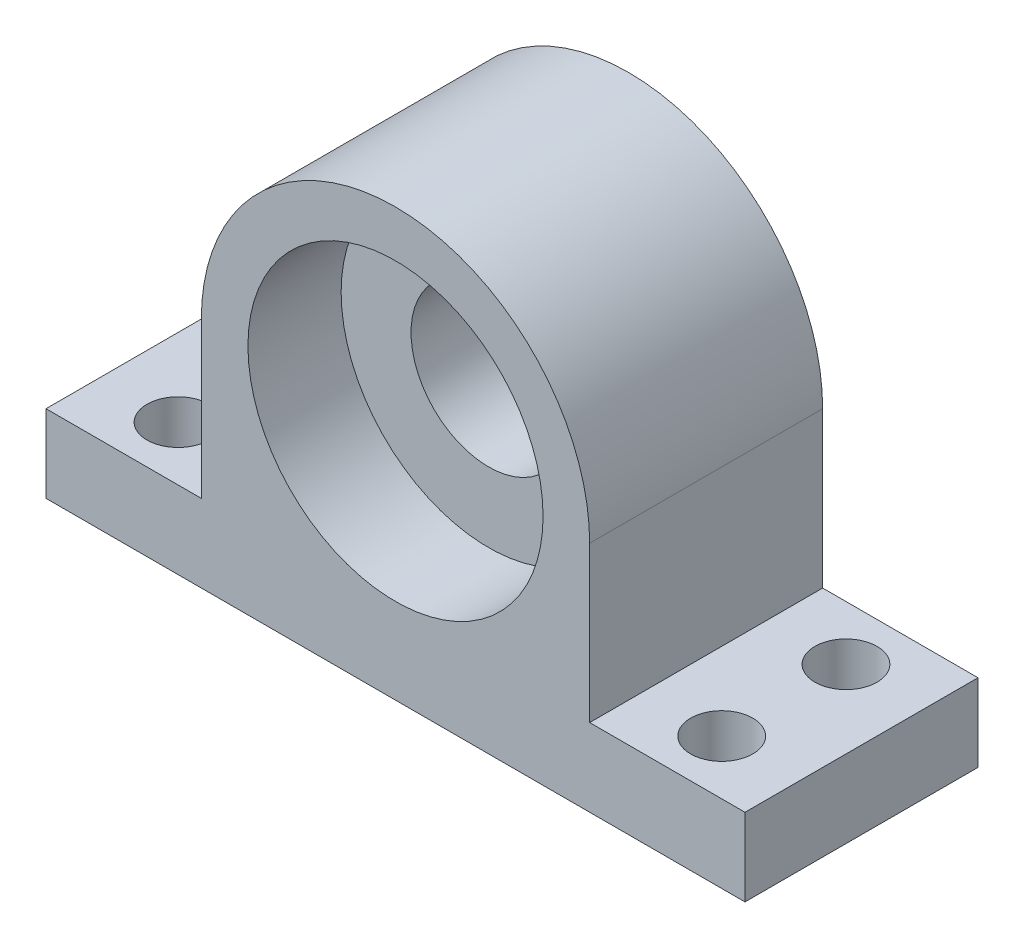
ISO-10303-21;
HEADER;
FILE_DESCRIPTION(('STEP AP214'),'2;1');
FILE_NAME('part.step','',(''),(''),'','','');
FILE_SCHEMA(('AUTOMOTIVE_DESIGN { 1 0 10303 214 1 1 1 1 }'));
ENDSEC;
DATA;
#1=APPLICATION_CONTEXT('core data for automotive mechanical design processes');
#2=APPLICATION_PROTOCOL_DEFINITION('international standard','automotive_design',2000,#1);
#3=PRODUCT_CONTEXT('',#1,'mechanical');
#4=PRODUCT('Part','Part','',(#3));
#5=PRODUCT_RELATED_PRODUCT_CATEGORY('part','',(#4));
#6=PRODUCT_DEFINITION_FORMATION('','',#4);
#7=PRODUCT_DEFINITION_CONTEXT('part definition',#1,'design');
#8=PRODUCT_DEFINITION('design','',#6,#7);
#9=PRODUCT_DEFINITION_SHAPE('','',#8);
#10=(LENGTH_UNIT() NAMED_UNIT(*) SI_UNIT(.MILLI.,.METRE.));
#11=(NAMED_UNIT(*) PLANE_ANGLE_UNIT() SI_UNIT($,.RADIAN.));
#12=(NAMED_UNIT(*) SI_UNIT($,.STERADIAN.) SOLID_ANGLE_UNIT());
#13=UNCERTAINTY_MEASURE_WITH_UNIT(LENGTH_MEASURE(1.E-05),#10,'distance_accuracy_value','');
#14=(GEOMETRIC_REPRESENTATION_CONTEXT(3) GLOBAL_UNCERTAINTY_ASSIGNED_CONTEXT((#13)) GLOBAL_UNIT_ASSIGNED_CONTEXT((#10,
#11,#12)) REPRESENTATION_CONTEXT('',''));
#15=CARTESIAN_POINT('',(0.,0.,0.));
#16=DIRECTION('',(0.,0.,1.));
#17=DIRECTION('',(1.,0.,0.));
#18=AXIS2_PLACEMENT_3D('',#15,#16,#17);
#19=CARTESIAN_POINT('',(0.,0.,15.));
#20=DIRECTION('',(0.,0.,-1.));
#21=DIRECTION('',(-1.,0.,0.));
#22=AXIS2_PLACEMENT_3D('',#19,#20,#21);
#23=CYLINDRICAL_SURFACE('',#22,5.);
#24=CARTESIAN_POINT('',(0.,0.,0.));
#25=DIRECTION('',(0.,0.,1.));
#26=DIRECTION('',(1.,0.,0.));
#27=AXIS2_PLACEMENT_3D('',#24,#25,#26);
#28=CIRCLE('',#27,5.);
#29=CARTESIAN_POINT('',(5.,0.,0.));
#30=VERTEX_POINT('',#29);
#31=EDGE_CURVE('E140',#30,#30,#28,.T.);
#32=ORIENTED_EDGE('',*,*,#31,.F.);
#33=EDGE_LOOP('',(#32));
#34=FACE_BOUND('',#33,.T.);
#35=CARTESIAN_POINT('',(0.,0.,9.));
#36=DIRECTION('',(0.,0.,1.));
#37=DIRECTION('',(1.,0.,0.));
#38=AXIS2_PLACEMENT_3D('',#35,#36,#37);
#39=CIRCLE('',#38,5.);
#40=CARTESIAN_POINT('',(5.,0.,9.));
#41=VERTEX_POINT('',#40);
#42=EDGE_CURVE('E42',#41,#41,#39,.T.);
#43=ORIENTED_EDGE('',*,*,#42,.T.);
#44=EDGE_LOOP('',(#43));
#45=FACE_BOUND('',#44,.T.);
#46=ADVANCED_FACE('F38',(#34,#45),#23,.F.);
#47=CARTESIAN_POINT('',(0.,0.,15.));
#48=DIRECTION('',(0.,0.,1.));
#49=DIRECTION('',(1.,0.,0.));
#50=AXIS2_PLACEMENT_3D('',#47,#48,#49);
#51=PLANE('',#50);
#52=CARTESIAN_POINT('',(0.,0.,15.));
#53=DIRECTION('',(0.,0.,1.));
#54=DIRECTION('',(1.,0.,0.));
#55=AXIS2_PLACEMENT_3D('',#52,#53,#54);
#56=CIRCLE('',#55,9.5);
#57=CARTESIAN_POINT('',(9.5,0.,15.));
#58=VERTEX_POINT('',#57);
#59=EDGE_CURVE('E188',#58,#58,#56,.T.);
#60=ORIENTED_EDGE('',*,*,#59,.F.);
#61=EDGE_LOOP('',(#60));
#62=FACE_BOUND('',#61,.T.);
#63=DIRECTION('',(0.,-1.,0.));
#64=VECTOR('',#63,1.);
#65=CARTESIAN_POINT('',(-22.5,-10.,15.));
#66=LINE('',#65,#64);
#67=CARTESIAN_POINT('',(-22.5,-10.,15.));
#68=VERTEX_POINT('',#67);
#69=CARTESIAN_POINT('',(-22.5,-15.,15.));
#70=VERTEX_POINT('',#69);
#71=EDGE_CURVE('E151',#68,#70,#66,.T.);
#72=ORIENTED_EDGE('',*,*,#71,.T.);
#73=DIRECTION('',(1.,0.,0.));
#74=VECTOR('',#73,1.);
#75=CARTESIAN_POINT('',(-22.5,-15.,15.));
#76=LINE('',#75,#74);
#77=CARTESIAN_POINT('',(22.5,-15.,15.));
#78=VERTEX_POINT('',#77);
#79=EDGE_CURVE('E99',#70,#78,#76,.T.);
#80=ORIENTED_EDGE('',*,*,#79,.T.);
#81=DIRECTION('',(0.,1.,0.));
#82=VECTOR('',#81,1.);
#83=CARTESIAN_POINT('',(22.5,-10.,15.));
#84=LINE('',#83,#82);
#85=CARTESIAN_POINT('',(22.5,-10.,15.));
#86=VERTEX_POINT('',#85);
#87=EDGE_CURVE('E167',#78,#86,#84,.T.);
#88=ORIENTED_EDGE('',*,*,#87,.T.);
#89=DIRECTION('',(-1.,0.,0.));
#90=VECTOR('',#89,1.);
#91=CARTESIAN_POINT('',(12.5,-10.,15.));
#92=LINE('',#91,#90);
#93=CARTESIAN_POINT('',(12.5,-10.,15.));
#94=VERTEX_POINT('',#93);
#95=EDGE_CURVE('E180',#86,#94,#92,.T.);
#96=ORIENTED_EDGE('',*,*,#95,.T.);
#97=DIRECTION('',(0.,1.,0.));
#98=VECTOR('',#97,1.);
#99=CARTESIAN_POINT('',(12.5,0.,15.));
#100=LINE('',#99,#98);
#101=CARTESIAN_POINT('',(12.5,0.,15.));
#102=VERTEX_POINT('',#101);
#103=EDGE_CURVE('E118',#94,#102,#100,.T.);
#104=ORIENTED_EDGE('',*,*,#103,.T.);
#105=CARTESIAN_POINT('',(0.,0.,15.));
#106=DIRECTION('',(0.,0.,1.));
#107=DIRECTION('',(1.,0.,0.));
#108=AXIS2_PLACEMENT_3D('',#105,#106,#107);
#109=CIRCLE('',#108,12.5);
#110=CARTESIAN_POINT('',(-12.5,0.,15.));
#111=VERTEX_POINT('',#110);
#112=EDGE_CURVE('E112',#102,#111,#109,.T.);
#113=ORIENTED_EDGE('',*,*,#112,.T.);
#114=DIRECTION('',(0.,-1.,0.));
#115=VECTOR('',#114,1.);
#116=CARTESIAN_POINT('',(-12.5,0.,15.));
#117=LINE('',#116,#115);
#118=CARTESIAN_POINT('',(-12.5,-10.,15.));
#119=VERTEX_POINT('',#118);
#120=EDGE_CURVE('E116',#111,#119,#117,.T.);
#121=ORIENTED_EDGE('',*,*,#120,.T.);
#122=DIRECTION('',(-1.,0.,0.));
#123=VECTOR('',#122,1.);
#124=CARTESIAN_POINT('',(-22.5,-10.,15.));
#125=LINE('',#124,#123);
#126=EDGE_CURVE('E56',#119,#68,#125,.T.);
#127=ORIENTED_EDGE('',*,*,#126,.T.);
#128=EDGE_LOOP('',(#72,#80,#88,#96,#104,#113,#121,#127));
#129=FACE_BOUND('',#128,.T.);
#130=ADVANCED_FACE('F114',(#62,#129),#51,.T.);
#131=CARTESIAN_POINT('',(0.,0.,0.));
#132=DIRECTION('',(0.,0.,1.));
#133=DIRECTION('',(1.,0.,0.));
#134=AXIS2_PLACEMENT_3D('',#131,#132,#133);
#135=PLANE('',#134);
#136=DIRECTION('',(0.,-1.,0.));
#137=VECTOR('',#136,1.);
#138=CARTESIAN_POINT('',(-22.5,-10.,0.));
#139=LINE('',#138,#137);
#140=CARTESIAN_POINT('',(-22.5,-10.,0.));
#141=VERTEX_POINT('',#140);
#142=CARTESIAN_POINT('',(-22.5,-15.,0.));
#143=VERTEX_POINT('',#142);
#144=EDGE_CURVE('E136',#141,#143,#139,.T.);
#145=ORIENTED_EDGE('',*,*,#144,.F.);
#146=DIRECTION('',(-1.,0.,0.));
#147=VECTOR('',#146,1.);
#148=CARTESIAN_POINT('',(-22.5,-10.,0.));
#149=LINE('',#148,#147);
#150=CARTESIAN_POINT('',(-12.5,-10.,0.));
#151=VERTEX_POINT('',#150);
#152=EDGE_CURVE('E91',#151,#141,#149,.T.);
#153=ORIENTED_EDGE('',*,*,#152,.F.);
#154=DIRECTION('',(0.,-1.,0.));
#155=VECTOR('',#154,1.);
#156=CARTESIAN_POINT('',(-12.5,0.,0.));
#157=LINE('',#156,#155);
#158=CARTESIAN_POINT('',(-12.5,0.,0.));
#159=VERTEX_POINT('',#158);
#160=EDGE_CURVE('E85',#159,#151,#157,.T.);
#161=ORIENTED_EDGE('',*,*,#160,.F.);
#162=CARTESIAN_POINT('',(0.,0.,0.));
#163=DIRECTION('',(0.,0.,1.));
#164=DIRECTION('',(1.,0.,0.));
#165=AXIS2_PLACEMENT_3D('',#162,#163,#164);
#166=CIRCLE('',#165,12.5);
#167=CARTESIAN_POINT('',(12.5,0.,0.));
#168=VERTEX_POINT('',#167);
#169=EDGE_CURVE('E126',#168,#159,#166,.T.);
#170=ORIENTED_EDGE('',*,*,#169,.F.);
#171=DIRECTION('',(0.,1.,0.));
#172=VECTOR('',#171,1.);
#173=CARTESIAN_POINT('',(12.5,0.,0.));
#174=LINE('',#173,#172);
#175=CARTESIAN_POINT('',(12.5,-10.,0.));
#176=VERTEX_POINT('',#175);
#177=EDGE_CURVE('E146',#176,#168,#174,.T.);
#178=ORIENTED_EDGE('',*,*,#177,.F.);
#179=DIRECTION('',(-1.,0.,0.));
#180=VECTOR('',#179,1.);
#181=CARTESIAN_POINT('',(12.5,-10.,0.));
#182=LINE('',#181,#180);
#183=CARTESIAN_POINT('',(22.5,-10.,0.));
#184=VERTEX_POINT('',#183);
#185=EDGE_CURVE('E144',#184,#176,#182,.T.);
#186=ORIENTED_EDGE('',*,*,#185,.F.);
#187=DIRECTION('',(0.,1.,0.));
#188=VECTOR('',#187,1.);
#189=CARTESIAN_POINT('',(22.5,-10.,0.));
#190=LINE('',#189,#188);
#191=CARTESIAN_POINT('',(22.5,-15.,0.));
#192=VERTEX_POINT('',#191);
#193=EDGE_CURVE('E142',#192,#184,#190,.T.);
#194=ORIENTED_EDGE('',*,*,#193,.F.);
#195=DIRECTION('',(1.,0.,0.));
#196=VECTOR('',#195,1.);
#197=CARTESIAN_POINT('',(-22.5,-15.,0.));
#198=LINE('',#197,#196);
#199=EDGE_CURVE('E139',#143,#192,#198,.T.);
#200=ORIENTED_EDGE('',*,*,#199,.F.);
#201=EDGE_LOOP('',(#145,#153,#161,#170,#178,#186,#194,#200));
#202=FACE_BOUND('',#201,.T.);
#203=ORIENTED_EDGE('',*,*,#31,.T.);
#204=EDGE_LOOP('',(#203));
#205=FACE_BOUND('',#204,.T.);
#206=ADVANCED_FACE('F171',(#202,#205),#135,.F.);
#207=CARTESIAN_POINT('',(-22.5,-10.,15.));
#208=DIRECTION('',(1.,0.,0.));
#209=DIRECTION('',(0.,0.,-1.));
#210=AXIS2_PLACEMENT_3D('',#207,#208,#209);
#211=PLANE('',#210);
#212=ORIENTED_EDGE('',*,*,#144,.T.);
#213=DIRECTION('',(0.,0.,-1.));
#214=VECTOR('',#213,1.);
#215=CARTESIAN_POINT('',(-22.5,-15.,15.));
#216=LINE('',#215,#214);
#217=EDGE_CURVE('E11',#70,#143,#216,.T.);
#218=ORIENTED_EDGE('',*,*,#217,.F.);
#219=ORIENTED_EDGE('',*,*,#71,.F.);
#220=DIRECTION('',(0.,0.,-1.));
#221=VECTOR('',#220,1.);
#222=CARTESIAN_POINT('',(-22.5,-10.,15.));
#223=LINE('',#222,#221);
#224=EDGE_CURVE('E132',#68,#141,#223,.T.);
#225=ORIENTED_EDGE('',*,*,#224,.T.);
#226=EDGE_LOOP('',(#212,#218,#219,#225));
#227=FACE_BOUND('',#226,.T.);
#228=ADVANCED_FACE('F40',(#227),#211,.F.);
#229=CARTESIAN_POINT('',(-22.5,-15.,15.));
#230=DIRECTION('',(0.,1.,0.));
#231=DIRECTION('',(0.,0.,1.));
#232=AXIS2_PLACEMENT_3D('',#229,#230,#231);
#233=PLANE('',#232);
#234=CARTESIAN_POINT('',(-17.5,-15.,3.5));
#235=DIRECTION('',(0.,1.,0.));
#236=DIRECTION('',(0.,0.,1.));
#237=AXIS2_PLACEMENT_3D('',#234,#235,#236);
#238=CIRCLE('',#237,2.);
#239=CARTESIAN_POINT('',(-17.5,-15.,5.5));
#240=VERTEX_POINT('',#239);
#241=EDGE_CURVE('E200',#240,#240,#238,.T.);
#242=ORIENTED_EDGE('',*,*,#241,.T.);
#243=EDGE_LOOP('',(#242));
#244=FACE_BOUND('',#243,.T.);
#245=CARTESIAN_POINT('',(-17.5,-15.,11.5));
#246=DIRECTION('',(0.,1.,0.));
#247=DIRECTION('',(0.,0.,1.));
#248=AXIS2_PLACEMENT_3D('',#245,#246,#247);
#249=CIRCLE('',#248,2.);
#250=CARTESIAN_POINT('',(-17.5,-15.,13.5));
#251=VERTEX_POINT('',#250);
#252=EDGE_CURVE('E203',#251,#251,#249,.T.);
#253=ORIENTED_EDGE('',*,*,#252,.T.);
#254=EDGE_LOOP('',(#253));
#255=FACE_BOUND('',#254,.T.);
#256=CARTESIAN_POINT('',(17.5,-15.,11.5));
#257=DIRECTION('',(0.,1.,0.));
#258=DIRECTION('',(0.,0.,1.));
#259=AXIS2_PLACEMENT_3D('',#256,#257,#258);
#260=CIRCLE('',#259,2.);
#261=CARTESIAN_POINT('',(17.5,-15.,13.5));
#262=VERTEX_POINT('',#261);
#263=EDGE_CURVE('E192',#262,#262,#260,.T.);
#264=ORIENTED_EDGE('',*,*,#263,.T.);
#265=EDGE_LOOP('',(#264));
#266=FACE_BOUND('',#265,.T.);
#267=CARTESIAN_POINT('',(17.5,-15.,3.5));
#268=DIRECTION('',(0.,1.,0.));
#269=DIRECTION('',(0.,0.,1.));
#270=AXIS2_PLACEMENT_3D('',#267,#268,#269);
#271=CIRCLE('',#270,2.);
#272=CARTESIAN_POINT('',(17.5,-15.,5.5));
#273=VERTEX_POINT('',#272);
#274=EDGE_CURVE('E197',#273,#273,#271,.T.);
#275=ORIENTED_EDGE('',*,*,#274,.T.);
#276=EDGE_LOOP('',(#275));
#277=FACE_BOUND('',#276,.T.);
#278=ORIENTED_EDGE('',*,*,#199,.T.);
#279=DIRECTION('',(0.,0.,-1.));
#280=VECTOR('',#279,1.);
#281=CARTESIAN_POINT('',(22.5,-15.,15.));
#282=LINE('',#281,#280);
#283=EDGE_CURVE('E48',#78,#192,#282,.T.);
#284=ORIENTED_EDGE('',*,*,#283,.F.);
#285=ORIENTED_EDGE('',*,*,#79,.F.);
#286=ORIENTED_EDGE('',*,*,#217,.T.);
#287=EDGE_LOOP('',(#278,#284,#285,#286));
#288=FACE_BOUND('',#287,.T.);
#289=ADVANCED_FACE('F234',(#244,#255,#266,#277,#288),#233,.F.);
#290=CARTESIAN_POINT('',(22.5,-10.,15.));
#291=DIRECTION('',(-1.,0.,0.));
#292=DIRECTION('',(0.,0.,1.));
#293=AXIS2_PLACEMENT_3D('',#290,#291,#292);
#294=PLANE('',#293);
#295=ORIENTED_EDGE('',*,*,#193,.T.);
#296=DIRECTION('',(0.,0.,-1.));
#297=VECTOR('',#296,1.);
#298=CARTESIAN_POINT('',(22.5,-10.,15.));
#299=LINE('',#298,#297);
#300=EDGE_CURVE('E158',#86,#184,#299,.T.);
#301=ORIENTED_EDGE('',*,*,#300,.F.);
#302=ORIENTED_EDGE('',*,*,#87,.F.);
#303=ORIENTED_EDGE('',*,*,#283,.T.);
#304=EDGE_LOOP('',(#295,#301,#302,#303));
#305=FACE_BOUND('',#304,.T.);
#306=ADVANCED_FACE('F165',(#305),#294,.F.);
#307=CARTESIAN_POINT('',(12.5,-10.,15.));
#308=DIRECTION('',(0.,-1.,0.));
#309=DIRECTION('',(0.,0.,-1.));
#310=AXIS2_PLACEMENT_3D('',#307,#308,#309);
#311=PLANE('',#310);
#312=CARTESIAN_POINT('',(17.5,-10.,11.5));
#313=DIRECTION('',(0.,1.,0.));
#314=DIRECTION('',(0.,0.,1.));
#315=AXIS2_PLACEMENT_3D('',#312,#313,#314);
#316=CIRCLE('',#315,2.);
#317=CARTESIAN_POINT('',(17.5,-10.,13.5));
#318=VERTEX_POINT('',#317);
#319=EDGE_CURVE('E209',#318,#318,#316,.T.);
#320=ORIENTED_EDGE('',*,*,#319,.F.);
#321=EDGE_LOOP('',(#320));
#322=FACE_BOUND('',#321,.T.);
#323=CARTESIAN_POINT('',(17.5,-10.,3.5));
#324=DIRECTION('',(0.,1.,0.));
#325=DIRECTION('',(0.,0.,1.));
#326=AXIS2_PLACEMENT_3D('',#323,#324,#325);
#327=CIRCLE('',#326,2.);
#328=CARTESIAN_POINT('',(17.5,-10.,5.5));
#329=VERTEX_POINT('',#328);
#330=EDGE_CURVE('E206',#329,#329,#327,.T.);
#331=ORIENTED_EDGE('',*,*,#330,.F.);
#332=EDGE_LOOP('',(#331));
#333=FACE_BOUND('',#332,.T.);
#334=ORIENTED_EDGE('',*,*,#185,.T.);
#335=DIRECTION('',(0.,0.,-1.));
#336=VECTOR('',#335,1.);
#337=CARTESIAN_POINT('',(12.5,-10.,15.));
#338=LINE('',#337,#336);
#339=EDGE_CURVE('E155',#94,#176,#338,.T.);
#340=ORIENTED_EDGE('',*,*,#339,.F.);
#341=ORIENTED_EDGE('',*,*,#95,.F.);
#342=ORIENTED_EDGE('',*,*,#300,.T.);
#343=EDGE_LOOP('',(#334,#340,#341,#342));
#344=FACE_BOUND('',#343,.T.);
#345=ADVANCED_FACE('F176',(#322,#333,#344),#311,.F.);
#346=CARTESIAN_POINT('',(12.5,0.,15.));
#347=DIRECTION('',(-1.,0.,0.));
#348=DIRECTION('',(0.,-1.,0.));
#349=AXIS2_PLACEMENT_3D('',#346,#347,#348);
#350=PLANE('',#349);
#351=ORIENTED_EDGE('',*,*,#177,.T.);
#352=DIRECTION('',(0.,0.,-1.));
#353=VECTOR('',#352,1.);
#354=CARTESIAN_POINT('',(12.5,0.,15.));
#355=LINE('',#354,#353);
#356=EDGE_CURVE('E127',#102,#168,#355,.T.);
#357=ORIENTED_EDGE('',*,*,#356,.F.);
#358=ORIENTED_EDGE('',*,*,#103,.F.);
#359=ORIENTED_EDGE('',*,*,#339,.T.);
#360=EDGE_LOOP('',(#351,#357,#358,#359));
#361=FACE_BOUND('',#360,.T.);
#362=ADVANCED_FACE('F179',(#361),#350,.F.);
#363=CARTESIAN_POINT('',(0.,0.,15.));
#364=DIRECTION('',(0.,0.,-1.));
#365=DIRECTION('',(-1.,0.,0.));
#366=AXIS2_PLACEMENT_3D('',#363,#364,#365);
#367=CYLINDRICAL_SURFACE('',#366,12.5);
#368=ORIENTED_EDGE('',*,*,#169,.T.);
#369=DIRECTION('',(0.,0.,-1.));
#370=VECTOR('',#369,1.);
#371=CARTESIAN_POINT('',(-12.5,0.,15.));
#372=LINE('',#371,#370);
#373=EDGE_CURVE('E123',#111,#159,#372,.T.);
#374=ORIENTED_EDGE('',*,*,#373,.F.);
#375=ORIENTED_EDGE('',*,*,#112,.F.);
#376=ORIENTED_EDGE('',*,*,#356,.T.);
#377=EDGE_LOOP('',(#368,#374,#375,#376));
#378=FACE_BOUND('',#377,.T.);
#379=ADVANCED_FACE('F124',(#378),#367,.T.);
#380=CARTESIAN_POINT('',(-12.5,0.,15.));
#381=DIRECTION('',(1.,0.,0.));
#382=DIRECTION('',(0.,1.,0.));
#383=AXIS2_PLACEMENT_3D('',#380,#381,#382);
#384=PLANE('',#383);
#385=ORIENTED_EDGE('',*,*,#160,.T.);
#386=DIRECTION('',(0.,0.,-1.));
#387=VECTOR('',#386,1.);
#388=CARTESIAN_POINT('',(-12.5,-10.,15.));
#389=LINE('',#388,#387);
#390=EDGE_CURVE('E128',#119,#151,#389,.T.);
#391=ORIENTED_EDGE('',*,*,#390,.F.);
#392=ORIENTED_EDGE('',*,*,#120,.F.);
#393=ORIENTED_EDGE('',*,*,#373,.T.);
#394=EDGE_LOOP('',(#385,#391,#392,#393));
#395=FACE_BOUND('',#394,.T.);
#396=ADVANCED_FACE('F130',(#395),#384,.F.);
#397=CARTESIAN_POINT('',(-22.5,-10.,15.));
#398=DIRECTION('',(0.,-1.,0.));
#399=DIRECTION('',(0.,0.,-1.));
#400=AXIS2_PLACEMENT_3D('',#397,#398,#399);
#401=PLANE('',#400);
#402=CARTESIAN_POINT('',(-17.5,-10.,3.5));
#403=DIRECTION('',(0.,1.,0.));
#404=DIRECTION('',(0.,0.,-1.));
#405=AXIS2_PLACEMENT_3D('',#402,#403,#404);
#406=CIRCLE('',#405,2.);
#407=CARTESIAN_POINT('',(-17.5,-10.,1.5));
#408=VERTEX_POINT('',#407);
#409=EDGE_CURVE('E210',#408,#408,#406,.T.);
#410=ORIENTED_EDGE('',*,*,#409,.F.);
#411=EDGE_LOOP('',(#410));
#412=FACE_BOUND('',#411,.T.);
#413=CARTESIAN_POINT('',(-17.5,-10.,11.5));
#414=DIRECTION('',(0.,1.,0.));
#415=DIRECTION('',(0.,0.,-1.));
#416=AXIS2_PLACEMENT_3D('',#413,#414,#415);
#417=CIRCLE('',#416,2.);
#418=CARTESIAN_POINT('',(-17.5,-10.,9.5));
#419=VERTEX_POINT('',#418);
#420=EDGE_CURVE('E213',#419,#419,#417,.T.);
#421=ORIENTED_EDGE('',*,*,#420,.F.);
#422=EDGE_LOOP('',(#421));
#423=FACE_BOUND('',#422,.T.);
#424=ORIENTED_EDGE('',*,*,#152,.T.);
#425=ORIENTED_EDGE('',*,*,#224,.F.);
#426=ORIENTED_EDGE('',*,*,#126,.F.);
#427=ORIENTED_EDGE('',*,*,#390,.T.);
#428=EDGE_LOOP('',(#424,#425,#426,#427));
#429=FACE_BOUND('',#428,.T.);
#430=ADVANCED_FACE('F240',(#412,#423,#429),#401,.F.);
#431=CARTESIAN_POINT('',(0.,0.,9.));
#432=DIRECTION('',(0.,0.,1.));
#433=DIRECTION('',(1.,0.,0.));
#434=AXIS2_PLACEMENT_3D('',#431,#432,#433);
#435=CYLINDRICAL_SURFACE('',#434,9.5);
#436=CARTESIAN_POINT('',(0.,0.,9.));
#437=DIRECTION('',(0.,0.,1.));
#438=DIRECTION('',(1.,0.,0.));
#439=AXIS2_PLACEMENT_3D('',#436,#437,#438);
#440=CIRCLE('',#439,9.5);
#441=CARTESIAN_POINT('',(9.5,0.,9.));
#442=VERTEX_POINT('',#441);
#443=EDGE_CURVE('E191',#442,#442,#440,.T.);
#444=ORIENTED_EDGE('',*,*,#443,.F.);
#445=EDGE_LOOP('',(#444));
#446=FACE_BOUND('',#445,.T.);
#447=ORIENTED_EDGE('',*,*,#59,.T.);
#448=EDGE_LOOP('',(#447));
#449=FACE_BOUND('',#448,.T.);
#450=ADVANCED_FACE('F242',(#446,#449),#435,.F.);
#451=CARTESIAN_POINT('',(0.,0.,9.));
#452=DIRECTION('',(0.,0.,1.));
#453=DIRECTION('',(1.,0.,0.));
#454=AXIS2_PLACEMENT_3D('',#451,#452,#453);
#455=PLANE('',#454);
#456=ORIENTED_EDGE('',*,*,#42,.F.);
#457=EDGE_LOOP('',(#456));
#458=FACE_BOUND('',#457,.T.);
#459=ORIENTED_EDGE('',*,*,#443,.T.);
#460=EDGE_LOOP('',(#459));
#461=FACE_BOUND('',#460,.T.);
#462=ADVANCED_FACE('F249',(#458,#461),#455,.T.);
#463=CARTESIAN_POINT('',(-17.5,-16.,11.5));
#464=DIRECTION('',(0.,1.,0.));
#465=DIRECTION('',(0.,0.,1.));
#466=AXIS2_PLACEMENT_3D('',#463,#464,#465);
#467=CYLINDRICAL_SURFACE('',#466,2.);
#468=ORIENTED_EDGE('',*,*,#420,.T.);
#469=EDGE_LOOP('',(#468));
#470=FACE_BOUND('',#469,.T.);
#471=ORIENTED_EDGE('',*,*,#252,.F.);
#472=EDGE_LOOP('',(#471));
#473=FACE_BOUND('',#472,.T.);
#474=ADVANCED_FACE('F333',(#470,#473),#467,.F.);
#475=CARTESIAN_POINT('',(-17.5,-16.,3.5));
#476=DIRECTION('',(0.,1.,0.));
#477=DIRECTION('',(0.,0.,1.));
#478=AXIS2_PLACEMENT_3D('',#475,#476,#477);
#479=CYLINDRICAL_SURFACE('',#478,2.);
#480=ORIENTED_EDGE('',*,*,#409,.T.);
#481=EDGE_LOOP('',(#480));
#482=FACE_BOUND('',#481,.T.);
#483=ORIENTED_EDGE('',*,*,#241,.F.);
#484=EDGE_LOOP('',(#483));
#485=FACE_BOUND('',#484,.T.);
#486=ADVANCED_FACE('F230',(#482,#485),#479,.F.);
#487=CARTESIAN_POINT('',(17.5,-16.,3.5));
#488=DIRECTION('',(0.,1.,0.));
#489=DIRECTION('',(0.,0.,1.));
#490=AXIS2_PLACEMENT_3D('',#487,#488,#489);
#491=CYLINDRICAL_SURFACE('',#490,2.);
#492=ORIENTED_EDGE('',*,*,#330,.T.);
#493=EDGE_LOOP('',(#492));
#494=FACE_BOUND('',#493,.T.);
#495=ORIENTED_EDGE('',*,*,#274,.F.);
#496=EDGE_LOOP('',(#495));
#497=FACE_BOUND('',#496,.T.);
#498=ADVANCED_FACE('F227',(#494,#497),#491,.F.);
#499=CARTESIAN_POINT('',(17.5,-16.,11.5));
#500=DIRECTION('',(0.,1.,0.));
#501=DIRECTION('',(0.,0.,1.));
#502=AXIS2_PLACEMENT_3D('',#499,#500,#501);
#503=CYLINDRICAL_SURFACE('',#502,2.);
#504=ORIENTED_EDGE('',*,*,#319,.T.);
#505=EDGE_LOOP('',(#504));
#506=FACE_BOUND('',#505,.T.);
#507=ORIENTED_EDGE('',*,*,#263,.F.);
#508=EDGE_LOOP('',(#507));
#509=FACE_BOUND('',#508,.T.);
#510=ADVANCED_FACE('F219',(#506,#509),#503,.F.);
#511=CLOSED_SHELL('',(#46,#130,#206,#228,#289,#306,#345,#362,#379,#396,#430,#450,#462,#474,#486,
#498,#510));
#512=MANIFOLD_SOLID_BREP('B2',#511);
#513=ADVANCED_BREP_SHAPE_REPRESENTATION('',(#18,#512),#14);
#514=SHAPE_DEFINITION_REPRESENTATION(#9,#513);
ENDSEC;
END-ISO-10303-21;
